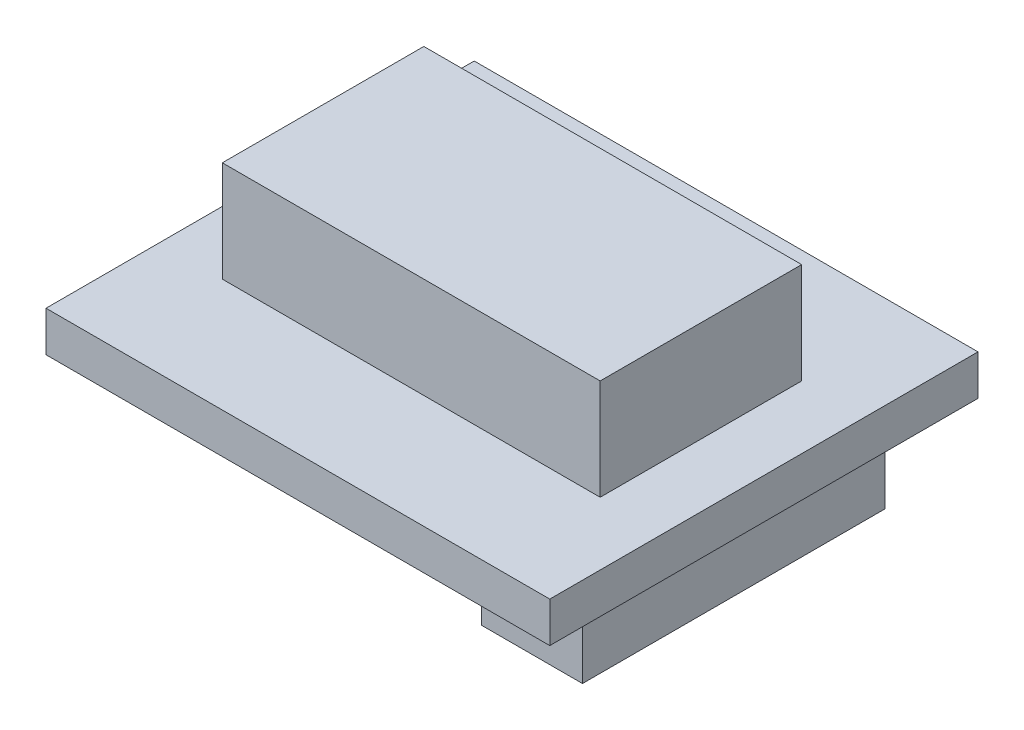
ISO-10303-21;
HEADER;
FILE_DESCRIPTION(('STEP AP214'),'2;1');
FILE_NAME('part.step','',(''),(''),'','','');
FILE_SCHEMA(('AUTOMOTIVE_DESIGN { 1 0 10303 214 1 1 1 1 }'));
ENDSEC;
DATA;
#1=APPLICATION_CONTEXT('core data for automotive mechanical design processes');
#2=APPLICATION_PROTOCOL_DEFINITION('international standard','automotive_design',2000,#1);
#3=PRODUCT_CONTEXT('',#1,'mechanical');
#4=PRODUCT('Part','Part','',(#3));
#5=PRODUCT_RELATED_PRODUCT_CATEGORY('part','',(#4));
#6=PRODUCT_DEFINITION_FORMATION('','',#4);
#7=PRODUCT_DEFINITION_CONTEXT('part definition',#1,'design');
#8=PRODUCT_DEFINITION('design','',#6,#7);
#9=PRODUCT_DEFINITION_SHAPE('','',#8);
#10=(LENGTH_UNIT() NAMED_UNIT(*) SI_UNIT(.MILLI.,.METRE.));
#11=(NAMED_UNIT(*) PLANE_ANGLE_UNIT() SI_UNIT($,.RADIAN.));
#12=(NAMED_UNIT(*) SI_UNIT($,.STERADIAN.) SOLID_ANGLE_UNIT());
#13=UNCERTAINTY_MEASURE_WITH_UNIT(LENGTH_MEASURE(1.E-05),#10,'distance_accuracy_value','');
#14=(GEOMETRIC_REPRESENTATION_CONTEXT(3) GLOBAL_UNCERTAINTY_ASSIGNED_CONTEXT((#13)) GLOBAL_UNIT_ASSIGNED_CONTEXT((#10,
#11,#12)) REPRESENTATION_CONTEXT('',''));
#15=CARTESIAN_POINT('',(0.,0.,0.));
#16=DIRECTION('',(0.,0.,1.));
#17=DIRECTION('',(1.,0.,0.));
#18=AXIS2_PLACEMENT_3D('',#15,#16,#17);
#19=CARTESIAN_POINT('',(0.,0.,0.));
#20=DIRECTION('',(0.,1.,0.));
#21=DIRECTION('',(0.,0.,1.));
#22=AXIS2_PLACEMENT_3D('',#19,#20,#21);
#23=PLANE('',#22);
#24=CARTESIAN_POINT('',(-35.,0.,-12.5));
#25=DIRECTION('',(0.,-1.,0.));
#26=DIRECTION('',(0.,0.,-1.));
#27=AXIS2_PLACEMENT_3D('',#24,#25,#26);
#28=CIRCLE('',#27,1.6);
#29=CARTESIAN_POINT('',(-35.,0.,-14.1));
#30=VERTEX_POINT('',#29);
#31=EDGE_CURVE('E387',#30,#30,#28,.T.);
#32=ORIENTED_EDGE('',*,*,#31,.F.);
#33=EDGE_LOOP('',(#32));
#34=FACE_BOUND('',#33,.T.);
#35=CARTESIAN_POINT('',(-35.,0.,12.5));
#36=DIRECTION('',(0.,-1.,0.));
#37=DIRECTION('',(0.,0.,-1.));
#38=AXIS2_PLACEMENT_3D('',#35,#36,#37);
#39=CIRCLE('',#38,1.6);
#40=CARTESIAN_POINT('',(-35.,0.,10.9));
#41=VERTEX_POINT('',#40);
#42=EDGE_CURVE('E379',#41,#41,#39,.T.);
#43=ORIENTED_EDGE('',*,*,#42,.F.);
#44=EDGE_LOOP('',(#43));
#45=FACE_BOUND('',#44,.T.);
#46=CARTESIAN_POINT('',(15.,0.,12.5));
#47=DIRECTION('',(0.,-1.,0.));
#48=DIRECTION('',(0.,0.,-1.));
#49=AXIS2_PLACEMENT_3D('',#46,#47,#48);
#50=CIRCLE('',#49,1.6);
#51=CARTESIAN_POINT('',(15.,0.,10.9));
#52=VERTEX_POINT('',#51);
#53=EDGE_CURVE('E365',#52,#52,#50,.T.);
#54=ORIENTED_EDGE('',*,*,#53,.F.);
#55=EDGE_LOOP('',(#54));
#56=FACE_BOUND('',#55,.T.);
#57=CARTESIAN_POINT('',(15.,0.,-12.5));
#58=DIRECTION('',(0.,-1.,0.));
#59=DIRECTION('',(0.,0.,-1.));
#60=AXIS2_PLACEMENT_3D('',#57,#58,#59);
#61=CIRCLE('',#60,1.6);
#62=CARTESIAN_POINT('',(15.,0.,-14.1));
#63=VERTEX_POINT('',#62);
#64=EDGE_CURVE('E364',#63,#63,#61,.T.);
#65=ORIENTED_EDGE('',*,*,#64,.F.);
#66=EDGE_LOOP('',(#65));
#67=FACE_BOUND('',#66,.T.);
#68=DIRECTION('',(0.,0.,-1.));
#69=VECTOR('',#68,1.);
#70=CARTESIAN_POINT('',(50.,0.,-42.5));
#71=LINE('',#70,#69);
#72=CARTESIAN_POINT('',(50.,0.,42.5));
#73=VERTEX_POINT('',#72);
#74=CARTESIAN_POINT('',(50.,0.,-42.5));
#75=VERTEX_POINT('',#74);
#76=EDGE_CURVE('E206',#73,#75,#71,.T.);
#77=ORIENTED_EDGE('',*,*,#76,.F.);
#78=DIRECTION('',(1.,0.,0.));
#79=VECTOR('',#78,1.);
#80=CARTESIAN_POINT('',(-50.,0.,42.5));
#81=LINE('',#80,#79);
#82=CARTESIAN_POINT('',(-50.,0.,42.5));
#83=VERTEX_POINT('',#82);
#84=EDGE_CURVE('E212',#83,#73,#81,.T.);
#85=ORIENTED_EDGE('',*,*,#84,.F.);
#86=DIRECTION('',(0.,0.,1.));
#87=VECTOR('',#86,1.);
#88=CARTESIAN_POINT('',(-50.,0.,-42.5));
#89=LINE('',#88,#87);
#90=CARTESIAN_POINT('',(-50.,0.,-42.5));
#91=VERTEX_POINT('',#90);
#92=EDGE_CURVE('E228',#91,#83,#89,.T.);
#93=ORIENTED_EDGE('',*,*,#92,.F.);
#94=DIRECTION('',(-1.,0.,0.));
#95=VECTOR('',#94,1.);
#96=CARTESIAN_POINT('',(-50.,0.,-42.5));
#97=LINE('',#96,#95);
#98=EDGE_CURVE('E225',#75,#91,#97,.T.);
#99=ORIENTED_EDGE('',*,*,#98,.F.);
#100=EDGE_LOOP('',(#77,#85,#93,#99));
#101=FACE_BOUND('',#100,.T.);
#102=DIRECTION('',(0.,0.,1.));
#103=VECTOR('',#102,1.);
#104=CARTESIAN_POINT('',(44.7687000318986,0.,30.777091897473));
#105=LINE('',#104,#103);
#106=CARTESIAN_POINT('',(44.7687000318986,0.,-29.222908102527));
#107=VERTEX_POINT('',#106);
#108=CARTESIAN_POINT('',(44.7687000318986,0.,30.777091897473));
#109=VERTEX_POINT('',#108);
#110=EDGE_CURVE('E153',#107,#109,#105,.T.);
#111=ORIENTED_EDGE('',*,*,#110,.F.);
#112=DIRECTION('',(1.,0.,0.));
#113=VECTOR('',#112,1.);
#114=CARTESIAN_POINT('',(24.7687000318986,0.,-29.222908102527));
#115=LINE('',#114,#113);
#116=CARTESIAN_POINT('',(24.7687000318986,0.,-29.222908102527));
#117=VERTEX_POINT('',#116);
#118=EDGE_CURVE('E150',#117,#107,#115,.T.);
#119=ORIENTED_EDGE('',*,*,#118,.F.);
#120=DIRECTION('',(0.,0.,-1.));
#121=VECTOR('',#120,1.);
#122=CARTESIAN_POINT('',(24.7687000318986,0.,30.777091897473));
#123=LINE('',#122,#121);
#124=CARTESIAN_POINT('',(24.7687000318986,0.,30.777091897473));
#125=VERTEX_POINT('',#124);
#126=EDGE_CURVE('E62',#125,#117,#123,.T.);
#127=ORIENTED_EDGE('',*,*,#126,.F.);
#128=DIRECTION('',(-1.,0.,0.));
#129=VECTOR('',#128,1.);
#130=CARTESIAN_POINT('',(24.7687000318986,0.,30.777091897473));
#131=LINE('',#130,#129);
#132=EDGE_CURVE('E57',#109,#125,#131,.T.);
#133=ORIENTED_EDGE('',*,*,#132,.F.);
#134=EDGE_LOOP('',(#111,#119,#127,#133));
#135=FACE_BOUND('',#134,.T.);
#136=ADVANCED_FACE('F41',(#34,#45,#56,#67,#101,#135),#23,.F.);
#137=CARTESIAN_POINT('',(50.,8.,-42.5));
#138=DIRECTION('',(-1.,0.,0.));
#139=DIRECTION('',(0.,0.,1.));
#140=AXIS2_PLACEMENT_3D('',#137,#138,#139);
#141=PLANE('',#140);
#142=ORIENTED_EDGE('',*,*,#76,.T.);
#143=DIRECTION('',(0.,-1.,0.));
#144=VECTOR('',#143,1.);
#145=CARTESIAN_POINT('',(50.,8.,-42.5));
#146=LINE('',#145,#144);
#147=CARTESIAN_POINT('',(50.,8.,-42.5));
#148=VERTEX_POINT('',#147);
#149=EDGE_CURVE('E11',#148,#75,#146,.T.);
#150=ORIENTED_EDGE('',*,*,#149,.F.);
#151=DIRECTION('',(0.,0.,-1.));
#152=VECTOR('',#151,1.);
#153=CARTESIAN_POINT('',(50.,8.,-42.5));
#154=LINE('',#153,#152);
#155=CARTESIAN_POINT('',(50.,8.,42.5));
#156=VERTEX_POINT('',#155);
#157=EDGE_CURVE('E207',#156,#148,#154,.T.);
#158=ORIENTED_EDGE('',*,*,#157,.F.);
#159=DIRECTION('',(0.,-1.,0.));
#160=VECTOR('',#159,1.);
#161=CARTESIAN_POINT('',(50.,8.,42.5));
#162=LINE('',#161,#160);
#163=EDGE_CURVE('E221',#156,#73,#162,.T.);
#164=ORIENTED_EDGE('',*,*,#163,.T.);
#165=EDGE_LOOP('',(#142,#150,#158,#164));
#166=FACE_BOUND('',#165,.T.);
#167=ADVANCED_FACE('F43',(#166),#141,.F.);
#168=CARTESIAN_POINT('',(-50.,8.,-42.5));
#169=DIRECTION('',(0.,0.,1.));
#170=DIRECTION('',(1.,0.,0.));
#171=AXIS2_PLACEMENT_3D('',#168,#169,#170);
#172=PLANE('',#171);
#173=ORIENTED_EDGE('',*,*,#98,.T.);
#174=DIRECTION('',(0.,-1.,0.));
#175=VECTOR('',#174,1.);
#176=CARTESIAN_POINT('',(-50.,8.,-42.5));
#177=LINE('',#176,#175);
#178=CARTESIAN_POINT('',(-50.,8.,-42.5));
#179=VERTEX_POINT('',#178);
#180=EDGE_CURVE('E50',#179,#91,#177,.T.);
#181=ORIENTED_EDGE('',*,*,#180,.F.);
#182=DIRECTION('',(-1.,0.,0.));
#183=VECTOR('',#182,1.);
#184=CARTESIAN_POINT('',(-50.,8.,-42.5));
#185=LINE('',#184,#183);
#186=EDGE_CURVE('E211',#148,#179,#185,.T.);
#187=ORIENTED_EDGE('',*,*,#186,.F.);
#188=ORIENTED_EDGE('',*,*,#149,.T.);
#189=EDGE_LOOP('',(#173,#181,#187,#188));
#190=FACE_BOUND('',#189,.T.);
#191=ADVANCED_FACE('F260',(#190),#172,.F.);
#192=CARTESIAN_POINT('',(-50.,8.,-42.5));
#193=DIRECTION('',(1.,0.,0.));
#194=DIRECTION('',(0.,0.,-1.));
#195=AXIS2_PLACEMENT_3D('',#192,#193,#194);
#196=PLANE('',#195);
#197=ORIENTED_EDGE('',*,*,#92,.T.);
#198=DIRECTION('',(0.,-1.,0.));
#199=VECTOR('',#198,1.);
#200=CARTESIAN_POINT('',(-50.,8.,42.5));
#201=LINE('',#200,#199);
#202=CARTESIAN_POINT('',(-50.,8.,42.5));
#203=VERTEX_POINT('',#202);
#204=EDGE_CURVE('E236',#203,#83,#201,.T.);
#205=ORIENTED_EDGE('',*,*,#204,.F.);
#206=DIRECTION('',(0.,0.,1.));
#207=VECTOR('',#206,1.);
#208=CARTESIAN_POINT('',(-50.,8.,-42.5));
#209=LINE('',#208,#207);
#210=EDGE_CURVE('E215',#179,#203,#209,.T.);
#211=ORIENTED_EDGE('',*,*,#210,.F.);
#212=ORIENTED_EDGE('',*,*,#180,.T.);
#213=EDGE_LOOP('',(#197,#205,#211,#212));
#214=FACE_BOUND('',#213,.T.);
#215=ADVANCED_FACE('F245',(#214),#196,.F.);
#216=CARTESIAN_POINT('',(-50.,8.,42.5));
#217=DIRECTION('',(0.,0.,-1.));
#218=DIRECTION('',(-1.,0.,0.));
#219=AXIS2_PLACEMENT_3D('',#216,#217,#218);
#220=PLANE('',#219);
#221=ORIENTED_EDGE('',*,*,#84,.T.);
#222=ORIENTED_EDGE('',*,*,#163,.F.);
#223=DIRECTION('',(1.,0.,0.));
#224=VECTOR('',#223,1.);
#225=CARTESIAN_POINT('',(-50.,8.,42.5));
#226=LINE('',#225,#224);
#227=EDGE_CURVE('E218',#203,#156,#226,.T.);
#228=ORIENTED_EDGE('',*,*,#227,.F.);
#229=ORIENTED_EDGE('',*,*,#204,.T.);
#230=EDGE_LOOP('',(#221,#222,#228,#229));
#231=FACE_BOUND('',#230,.T.);
#232=ADVANCED_FACE('F253',(#231),#220,.F.);
#233=CARTESIAN_POINT('',(0.,8.,0.));
#234=DIRECTION('',(0.,1.,0.));
#235=DIRECTION('',(0.,0.,1.));
#236=AXIS2_PLACEMENT_3D('',#233,#234,#235);
#237=PLANE('',#236);
#238=DIRECTION('',(0.,0.,-1.));
#239=VECTOR('',#238,1.);
#240=CARTESIAN_POINT('',(37.5,8.,-20.));
#241=LINE('',#240,#239);
#242=CARTESIAN_POINT('',(37.5,8.,20.));
#243=VERTEX_POINT('',#242);
#244=CARTESIAN_POINT('',(37.5,8.,-20.));
#245=VERTEX_POINT('',#244);
#246=EDGE_CURVE('E155',#243,#245,#241,.T.);
#247=ORIENTED_EDGE('',*,*,#246,.F.);
#248=DIRECTION('',(1.,0.,0.));
#249=VECTOR('',#248,1.);
#250=CARTESIAN_POINT('',(-37.5,8.,20.));
#251=LINE('',#250,#249);
#252=CARTESIAN_POINT('',(-37.5,8.,20.));
#253=VERTEX_POINT('',#252);
#254=EDGE_CURVE('E171',#253,#243,#251,.T.);
#255=ORIENTED_EDGE('',*,*,#254,.F.);
#256=DIRECTION('',(0.,0.,1.));
#257=VECTOR('',#256,1.);
#258=CARTESIAN_POINT('',(-37.5,8.,-20.));
#259=LINE('',#258,#257);
#260=CARTESIAN_POINT('',(-37.5,8.,-20.));
#261=VERTEX_POINT('',#260);
#262=EDGE_CURVE('E184',#261,#253,#259,.T.);
#263=ORIENTED_EDGE('',*,*,#262,.F.);
#264=DIRECTION('',(-1.,0.,0.));
#265=VECTOR('',#264,1.);
#266=CARTESIAN_POINT('',(-37.5,8.,-20.));
#267=LINE('',#266,#265);
#268=EDGE_CURVE('E160',#245,#261,#267,.T.);
#269=ORIENTED_EDGE('',*,*,#268,.F.);
#270=EDGE_LOOP('',(#247,#255,#263,#269));
#271=FACE_BOUND('',#270,.T.);
#272=ORIENTED_EDGE('',*,*,#157,.T.);
#273=ORIENTED_EDGE('',*,*,#186,.T.);
#274=ORIENTED_EDGE('',*,*,#210,.T.);
#275=ORIENTED_EDGE('',*,*,#227,.T.);
#276=EDGE_LOOP('',(#272,#273,#274,#275));
#277=FACE_BOUND('',#276,.T.);
#278=ADVANCED_FACE('F259',(#271,#277),#237,.T.);
#279=CARTESIAN_POINT('',(37.5,28.,-20.));
#280=DIRECTION('',(-1.,0.,0.));
#281=DIRECTION('',(0.,0.,1.));
#282=AXIS2_PLACEMENT_3D('',#279,#280,#281);
#283=PLANE('',#282);
#284=ORIENTED_EDGE('',*,*,#246,.T.);
#285=DIRECTION('',(0.,-1.,0.));
#286=VECTOR('',#285,1.);
#287=CARTESIAN_POINT('',(37.5,28.,-20.));
#288=LINE('',#287,#286);
#289=CARTESIAN_POINT('',(37.5,28.,-20.));
#290=VERTEX_POINT('',#289);
#291=EDGE_CURVE('E202',#290,#245,#288,.T.);
#292=ORIENTED_EDGE('',*,*,#291,.F.);
#293=DIRECTION('',(0.,0.,-1.));
#294=VECTOR('',#293,1.);
#295=CARTESIAN_POINT('',(37.5,28.,-20.));
#296=LINE('',#295,#294);
#297=CARTESIAN_POINT('',(37.5,28.,20.));
#298=VERTEX_POINT('',#297);
#299=EDGE_CURVE('E166',#298,#290,#296,.T.);
#300=ORIENTED_EDGE('',*,*,#299,.F.);
#301=DIRECTION('',(0.,-1.,0.));
#302=VECTOR('',#301,1.);
#303=CARTESIAN_POINT('',(37.5,28.,20.));
#304=LINE('',#303,#302);
#305=EDGE_CURVE('E179',#298,#243,#304,.T.);
#306=ORIENTED_EDGE('',*,*,#305,.T.);
#307=EDGE_LOOP('',(#284,#292,#300,#306));
#308=FACE_BOUND('',#307,.T.);
#309=ADVANCED_FACE('F281',(#308),#283,.F.);
#310=CARTESIAN_POINT('',(-37.5,28.,-20.));
#311=DIRECTION('',(0.,0.,1.));
#312=DIRECTION('',(1.,0.,0.));
#313=AXIS2_PLACEMENT_3D('',#310,#311,#312);
#314=PLANE('',#313);
#315=ORIENTED_EDGE('',*,*,#268,.T.);
#316=DIRECTION('',(0.,-1.,0.));
#317=VECTOR('',#316,1.);
#318=CARTESIAN_POINT('',(-37.5,28.,-20.));
#319=LINE('',#318,#317);
#320=CARTESIAN_POINT('',(-37.5,28.,-20.));
#321=VERTEX_POINT('',#320);
#322=EDGE_CURVE('E198',#321,#261,#319,.T.);
#323=ORIENTED_EDGE('',*,*,#322,.F.);
#324=DIRECTION('',(-1.,0.,0.));
#325=VECTOR('',#324,1.);
#326=CARTESIAN_POINT('',(-37.5,28.,-20.));
#327=LINE('',#326,#325);
#328=EDGE_CURVE('E170',#290,#321,#327,.T.);
#329=ORIENTED_EDGE('',*,*,#328,.F.);
#330=ORIENTED_EDGE('',*,*,#291,.T.);
#331=EDGE_LOOP('',(#315,#323,#329,#330));
#332=FACE_BOUND('',#331,.T.);
#333=ADVANCED_FACE('F286',(#332),#314,.F.);
#334=CARTESIAN_POINT('',(-37.5,28.,-20.));
#335=DIRECTION('',(1.,0.,0.));
#336=DIRECTION('',(0.,0.,-1.));
#337=AXIS2_PLACEMENT_3D('',#334,#335,#336);
#338=PLANE('',#337);
#339=ORIENTED_EDGE('',*,*,#262,.T.);
#340=DIRECTION('',(0.,-1.,0.));
#341=VECTOR('',#340,1.);
#342=CARTESIAN_POINT('',(-37.5,28.,20.));
#343=LINE('',#342,#341);
#344=CARTESIAN_POINT('',(-37.5,28.,20.));
#345=VERTEX_POINT('',#344);
#346=EDGE_CURVE('E194',#345,#253,#343,.T.);
#347=ORIENTED_EDGE('',*,*,#346,.F.);
#348=DIRECTION('',(0.,0.,1.));
#349=VECTOR('',#348,1.);
#350=CARTESIAN_POINT('',(-37.5,28.,-20.));
#351=LINE('',#350,#349);
#352=EDGE_CURVE('E174',#321,#345,#351,.T.);
#353=ORIENTED_EDGE('',*,*,#352,.F.);
#354=ORIENTED_EDGE('',*,*,#322,.T.);
#355=EDGE_LOOP('',(#339,#347,#353,#354));
#356=FACE_BOUND('',#355,.T.);
#357=ADVANCED_FACE('F300',(#356),#338,.F.);
#358=CARTESIAN_POINT('',(-37.5,28.,20.));
#359=DIRECTION('',(0.,0.,-1.));
#360=DIRECTION('',(-1.,0.,0.));
#361=AXIS2_PLACEMENT_3D('',#358,#359,#360);
#362=PLANE('',#361);
#363=ORIENTED_EDGE('',*,*,#254,.T.);
#364=ORIENTED_EDGE('',*,*,#305,.F.);
#365=DIRECTION('',(1.,0.,0.));
#366=VECTOR('',#365,1.);
#367=CARTESIAN_POINT('',(-37.5,28.,20.));
#368=LINE('',#367,#366);
#369=EDGE_CURVE('E177',#345,#298,#368,.T.);
#370=ORIENTED_EDGE('',*,*,#369,.F.);
#371=ORIENTED_EDGE('',*,*,#346,.T.);
#372=EDGE_LOOP('',(#363,#364,#370,#371));
#373=FACE_BOUND('',#372,.T.);
#374=ADVANCED_FACE('F291',(#373),#362,.F.);
#375=CARTESIAN_POINT('',(0.,28.,0.));
#376=DIRECTION('',(0.,1.,0.));
#377=DIRECTION('',(0.,0.,1.));
#378=AXIS2_PLACEMENT_3D('',#375,#376,#377);
#379=PLANE('',#378);
#380=ORIENTED_EDGE('',*,*,#299,.T.);
#381=ORIENTED_EDGE('',*,*,#328,.T.);
#382=ORIENTED_EDGE('',*,*,#352,.T.);
#383=ORIENTED_EDGE('',*,*,#369,.T.);
#384=EDGE_LOOP('',(#380,#381,#382,#383));
#385=FACE_BOUND('',#384,.T.);
#386=ADVANCED_FACE('F296',(#385),#379,.T.);
#387=CARTESIAN_POINT('',(44.7687000318986,-15.,30.777091897473));
#388=DIRECTION('',(-1.,0.,0.));
#389=DIRECTION('',(0.,0.,1.));
#390=AXIS2_PLACEMENT_3D('',#387,#388,#389);
#391=PLANE('',#390);
#392=ORIENTED_EDGE('',*,*,#110,.T.);
#393=DIRECTION('',(0.,1.,0.));
#394=VECTOR('',#393,1.);
#395=CARTESIAN_POINT('',(44.7687000318986,-15.,30.777091897473));
#396=LINE('',#395,#394);
#397=CARTESIAN_POINT('',(44.7687000318986,-15.,30.777091897473));
#398=VERTEX_POINT('',#397);
#399=EDGE_CURVE('E132',#398,#109,#396,.T.);
#400=ORIENTED_EDGE('',*,*,#399,.F.);
#401=DIRECTION('',(0.,0.,1.));
#402=VECTOR('',#401,1.);
#403=CARTESIAN_POINT('',(44.7687000318986,-15.,30.777091897473));
#404=LINE('',#403,#402);
#405=CARTESIAN_POINT('',(44.7687000318986,-15.,-29.222908102527));
#406=VERTEX_POINT('',#405);
#407=EDGE_CURVE('E140',#406,#398,#404,.T.);
#408=ORIENTED_EDGE('',*,*,#407,.F.);
#409=DIRECTION('',(0.,1.,0.));
#410=VECTOR('',#409,1.);
#411=CARTESIAN_POINT('',(44.7687000318986,-15.,-29.222908102527));
#412=LINE('',#411,#410);
#413=EDGE_CURVE('E398',#406,#107,#412,.T.);
#414=ORIENTED_EDGE('',*,*,#413,.T.);
#415=EDGE_LOOP('',(#392,#400,#408,#414));
#416=FACE_BOUND('',#415,.T.);
#417=ADVANCED_FACE('F152',(#416),#391,.F.);
#418=CARTESIAN_POINT('',(24.7687000318986,-15.,30.777091897473));
#419=DIRECTION('',(0.,0.,-1.));
#420=DIRECTION('',(-1.,0.,0.));
#421=AXIS2_PLACEMENT_3D('',#418,#419,#420);
#422=PLANE('',#421);
#423=ORIENTED_EDGE('',*,*,#132,.T.);
#424=DIRECTION('',(0.,1.,0.));
#425=VECTOR('',#424,1.);
#426=CARTESIAN_POINT('',(24.7687000318986,-15.,30.777091897473));
#427=LINE('',#426,#425);
#428=CARTESIAN_POINT('',(24.7687000318986,-15.,30.777091897473));
#429=VERTEX_POINT('',#428);
#430=EDGE_CURVE('E135',#429,#125,#427,.T.);
#431=ORIENTED_EDGE('',*,*,#430,.F.);
#432=DIRECTION('',(-1.,0.,0.));
#433=VECTOR('',#432,1.);
#434=CARTESIAN_POINT('',(24.7687000318986,-15.,30.777091897473));
#435=LINE('',#434,#433);
#436=EDGE_CURVE('E128',#398,#429,#435,.T.);
#437=ORIENTED_EDGE('',*,*,#436,.F.);
#438=ORIENTED_EDGE('',*,*,#399,.T.);
#439=EDGE_LOOP('',(#423,#431,#437,#438));
#440=FACE_BOUND('',#439,.T.);
#441=ADVANCED_FACE('F130',(#440),#422,.F.);
#442=CARTESIAN_POINT('',(24.7687000318986,-15.,30.777091897473));
#443=DIRECTION('',(1.,0.,0.));
#444=DIRECTION('',(0.,0.,-1.));
#445=AXIS2_PLACEMENT_3D('',#442,#443,#444);
#446=PLANE('',#445);
#447=ORIENTED_EDGE('',*,*,#126,.T.);
#448=DIRECTION('',(0.,1.,0.));
#449=VECTOR('',#448,1.);
#450=CARTESIAN_POINT('',(24.7687000318986,-15.,-29.222908102527));
#451=LINE('',#450,#449);
#452=CARTESIAN_POINT('',(24.7687000318986,-15.,-29.222908102527));
#453=VERTEX_POINT('',#452);
#454=EDGE_CURVE('E162',#453,#117,#451,.T.);
#455=ORIENTED_EDGE('',*,*,#454,.F.);
#456=DIRECTION('',(0.,0.,-1.));
#457=VECTOR('',#456,1.);
#458=CARTESIAN_POINT('',(24.7687000318986,-15.,30.777091897473));
#459=LINE('',#458,#457);
#460=EDGE_CURVE('E139',#429,#453,#459,.T.);
#461=ORIENTED_EDGE('',*,*,#460,.F.);
#462=ORIENTED_EDGE('',*,*,#430,.T.);
#463=EDGE_LOOP('',(#447,#455,#461,#462));
#464=FACE_BOUND('',#463,.T.);
#465=ADVANCED_FACE('F317',(#464),#446,.F.);
#466=CARTESIAN_POINT('',(24.7687000318986,-15.,-29.222908102527));
#467=DIRECTION('',(0.,0.,1.));
#468=DIRECTION('',(1.,0.,0.));
#469=AXIS2_PLACEMENT_3D('',#466,#467,#468);
#470=PLANE('',#469);
#471=ORIENTED_EDGE('',*,*,#118,.T.);
#472=ORIENTED_EDGE('',*,*,#413,.F.);
#473=DIRECTION('',(1.,0.,0.));
#474=VECTOR('',#473,1.);
#475=CARTESIAN_POINT('',(24.7687000318986,-15.,-29.222908102527));
#476=LINE('',#475,#474);
#477=EDGE_CURVE('E145',#453,#406,#476,.T.);
#478=ORIENTED_EDGE('',*,*,#477,.F.);
#479=ORIENTED_EDGE('',*,*,#454,.T.);
#480=EDGE_LOOP('',(#471,#472,#478,#479));
#481=FACE_BOUND('',#480,.T.);
#482=ADVANCED_FACE('F320',(#481),#470,.F.);
#483=CARTESIAN_POINT('',(0.,-15.,0.));
#484=DIRECTION('',(0.,-1.,0.));
#485=DIRECTION('',(0.,0.,-1.));
#486=AXIS2_PLACEMENT_3D('',#483,#484,#485);
#487=PLANE('',#486);
#488=ORIENTED_EDGE('',*,*,#407,.T.);
#489=ORIENTED_EDGE('',*,*,#436,.T.);
#490=ORIENTED_EDGE('',*,*,#460,.T.);
#491=ORIENTED_EDGE('',*,*,#477,.T.);
#492=EDGE_LOOP('',(#488,#489,#490,#491));
#493=FACE_BOUND('',#492,.T.);
#494=ADVANCED_FACE('F143',(#493),#487,.T.);
#495=CARTESIAN_POINT('',(15.,8.,-12.5));
#496=DIRECTION('',(0.,-1.,0.));
#497=DIRECTION('',(0.,0.,-1.));
#498=AXIS2_PLACEMENT_3D('',#495,#496,#497);
#499=CYLINDRICAL_SURFACE('',#498,1.6);
#500=CARTESIAN_POINT('',(15.,8.,-12.5));
#501=DIRECTION('',(0.,-1.,0.));
#502=DIRECTION('',(0.,0.,-1.));
#503=AXIS2_PLACEMENT_3D('',#500,#501,#502);
#504=CIRCLE('',#503,1.6);
#505=CARTESIAN_POINT('',(15.,8.,-14.1));
#506=VERTEX_POINT('',#505);
#507=EDGE_CURVE('E370',#506,#506,#504,.T.);
#508=ORIENTED_EDGE('',*,*,#507,.F.);
#509=EDGE_LOOP('',(#508));
#510=FACE_BOUND('',#509,.T.);
#511=ORIENTED_EDGE('',*,*,#64,.T.);
#512=EDGE_LOOP('',(#511));
#513=FACE_BOUND('',#512,.T.);
#514=ADVANCED_FACE('F327',(#510,#513),#499,.F.);
#515=CARTESIAN_POINT('',(15.,8.,-12.5));
#516=DIRECTION('',(0.,-1.,0.));
#517=DIRECTION('',(0.,0.,-1.));
#518=AXIS2_PLACEMENT_3D('',#515,#516,#517);
#519=PLANE('',#518);
#520=ORIENTED_EDGE('',*,*,#507,.T.);
#521=EDGE_LOOP('',(#520));
#522=FACE_BOUND('',#521,.T.);
#523=ADVANCED_FACE('F330',(#522),#519,.T.);
#524=CARTESIAN_POINT('',(15.,8.,12.5));
#525=DIRECTION('',(0.,-1.,0.));
#526=DIRECTION('',(0.,0.,-1.));
#527=AXIS2_PLACEMENT_3D('',#524,#525,#526);
#528=CYLINDRICAL_SURFACE('',#527,1.6);
#529=CARTESIAN_POINT('',(15.,8.,12.5));
#530=DIRECTION('',(0.,-1.,0.));
#531=DIRECTION('',(0.,0.,-1.));
#532=AXIS2_PLACEMENT_3D('',#529,#530,#531);
#533=CIRCLE('',#532,1.6);
#534=CARTESIAN_POINT('',(15.,8.,10.9));
#535=VERTEX_POINT('',#534);
#536=EDGE_CURVE('E362',#535,#535,#533,.T.);
#537=ORIENTED_EDGE('',*,*,#536,.F.);
#538=EDGE_LOOP('',(#537));
#539=FACE_BOUND('',#538,.T.);
#540=ORIENTED_EDGE('',*,*,#53,.T.);
#541=EDGE_LOOP('',(#540));
#542=FACE_BOUND('',#541,.T.);
#543=ADVANCED_FACE('F334',(#539,#542),#528,.F.);
#544=CARTESIAN_POINT('',(15.,8.,12.5));
#545=DIRECTION('',(0.,-1.,0.));
#546=DIRECTION('',(0.,0.,-1.));
#547=AXIS2_PLACEMENT_3D('',#544,#545,#546);
#548=PLANE('',#547);
#549=ORIENTED_EDGE('',*,*,#536,.T.);
#550=EDGE_LOOP('',(#549));
#551=FACE_BOUND('',#550,.T.);
#552=ADVANCED_FACE('F348',(#551),#548,.T.);
#553=CARTESIAN_POINT('',(-35.,8.,12.5));
#554=DIRECTION('',(0.,-1.,0.));
#555=DIRECTION('',(0.,0.,-1.));
#556=AXIS2_PLACEMENT_3D('',#553,#554,#555);
#557=CYLINDRICAL_SURFACE('',#556,1.6);
#558=CARTESIAN_POINT('',(-35.,8.,12.5));
#559=DIRECTION('',(0.,-1.,0.));
#560=DIRECTION('',(0.,0.,-1.));
#561=AXIS2_PLACEMENT_3D('',#558,#559,#560);
#562=CIRCLE('',#561,1.6);
#563=CARTESIAN_POINT('',(-35.,8.,10.9));
#564=VERTEX_POINT('',#563);
#565=EDGE_CURVE('E373',#564,#564,#562,.T.);
#566=ORIENTED_EDGE('',*,*,#565,.F.);
#567=EDGE_LOOP('',(#566));
#568=FACE_BOUND('',#567,.T.);
#569=ORIENTED_EDGE('',*,*,#42,.T.);
#570=EDGE_LOOP('',(#569));
#571=FACE_BOUND('',#570,.T.);
#572=ADVANCED_FACE('F345',(#568,#571),#557,.F.);
#573=CARTESIAN_POINT('',(-35.,8.,12.5));
#574=DIRECTION('',(0.,-1.,0.));
#575=DIRECTION('',(0.,0.,-1.));
#576=AXIS2_PLACEMENT_3D('',#573,#574,#575);
#577=PLANE('',#576);
#578=ORIENTED_EDGE('',*,*,#565,.T.);
#579=EDGE_LOOP('',(#578));
#580=FACE_BOUND('',#579,.T.);
#581=ADVANCED_FACE('F340',(#580),#577,.T.);
#582=CARTESIAN_POINT('',(-35.,8.,-12.5));
#583=DIRECTION('',(0.,-1.,0.));
#584=DIRECTION('',(0.,0.,-1.));
#585=AXIS2_PLACEMENT_3D('',#582,#583,#584);
#586=CYLINDRICAL_SURFACE('',#585,1.6);
#587=CARTESIAN_POINT('',(-35.,8.,-12.5));
#588=DIRECTION('',(0.,-1.,0.));
#589=DIRECTION('',(0.,0.,-1.));
#590=AXIS2_PLACEMENT_3D('',#587,#588,#589);
#591=CIRCLE('',#590,1.6);
#592=CARTESIAN_POINT('',(-35.,8.,-14.1));
#593=VERTEX_POINT('',#592);
#594=EDGE_CURVE('E383',#593,#593,#591,.T.);
#595=ORIENTED_EDGE('',*,*,#594,.F.);
#596=EDGE_LOOP('',(#595));
#597=FACE_BOUND('',#596,.T.);
#598=ORIENTED_EDGE('',*,*,#31,.T.);
#599=EDGE_LOOP('',(#598));
#600=FACE_BOUND('',#599,.T.);
#601=ADVANCED_FACE('F336',(#597,#600),#586,.F.);
#602=CARTESIAN_POINT('',(-35.,8.,-12.5));
#603=DIRECTION('',(0.,-1.,0.));
#604=DIRECTION('',(0.,0.,-1.));
#605=AXIS2_PLACEMENT_3D('',#602,#603,#604);
#606=PLANE('',#605);
#607=ORIENTED_EDGE('',*,*,#594,.T.);
#608=EDGE_LOOP('',(#607));
#609=FACE_BOUND('',#608,.T.);
#610=ADVANCED_FACE('F339',(#609),#606,.T.);
#611=CLOSED_SHELL('',(#136,#167,#191,#215,#232,#278,#309,#333,#357,#374,#386,#417,#441,#465,
#482,#494,#514,#523,#543,#552,#572,#581,#601,#610));
#612=MANIFOLD_SOLID_BREP('B2',#611);
#613=ADVANCED_BREP_SHAPE_REPRESENTATION('',(#18,#612),#14);
#614=SHAPE_DEFINITION_REPRESENTATION(#9,#613);
ENDSEC;
END-ISO-10303-21;
